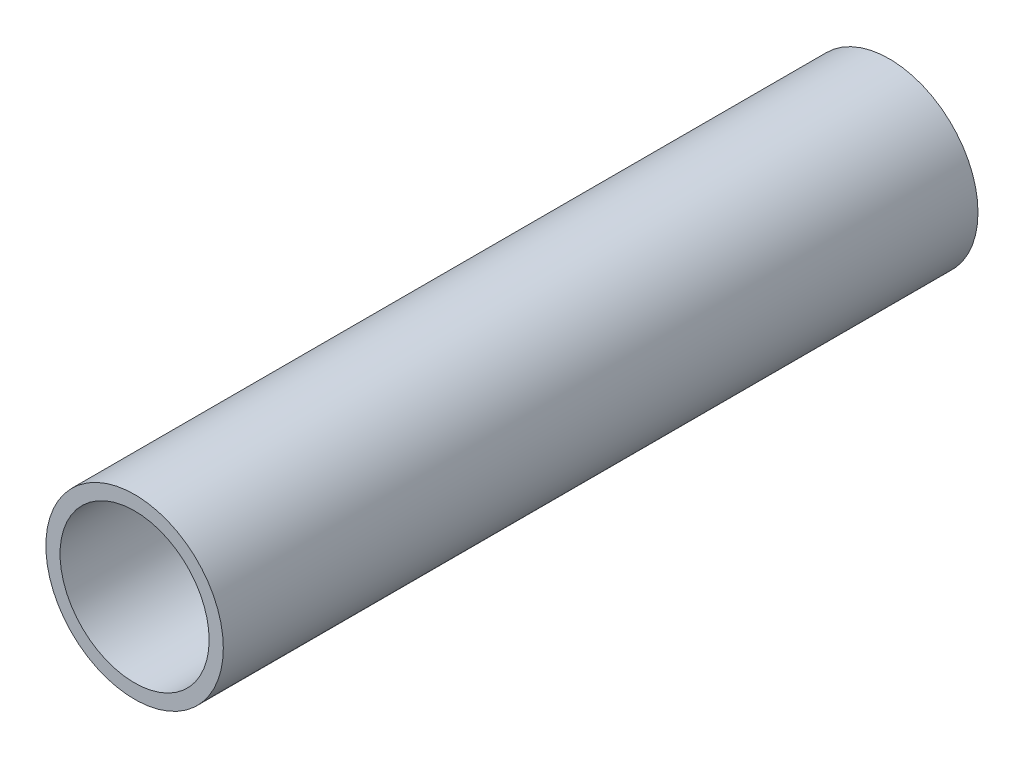
ISO-10303-21;
HEADER;
FILE_DESCRIPTION(('STEP AP214'),'2;1');
FILE_NAME('part.step','',(''),(''),'','','');
FILE_SCHEMA(('AUTOMOTIVE_DESIGN { 1 0 10303 214 1 1 1 1 }'));
ENDSEC;
DATA;
#1=APPLICATION_CONTEXT('core data for automotive mechanical design processes');
#2=APPLICATION_PROTOCOL_DEFINITION('international standard','automotive_design',2000,#1);
#3=PRODUCT_CONTEXT('',#1,'mechanical');
#4=PRODUCT('Part','Part','',(#3));
#5=PRODUCT_RELATED_PRODUCT_CATEGORY('part','',(#4));
#6=PRODUCT_DEFINITION_FORMATION('','',#4);
#7=PRODUCT_DEFINITION_CONTEXT('part definition',#1,'design');
#8=PRODUCT_DEFINITION('design','',#6,#7);
#9=PRODUCT_DEFINITION_SHAPE('','',#8);
#10=(LENGTH_UNIT() NAMED_UNIT(*) SI_UNIT(.MILLI.,.METRE.));
#11=(NAMED_UNIT(*) PLANE_ANGLE_UNIT() SI_UNIT($,.RADIAN.));
#12=(NAMED_UNIT(*) SI_UNIT($,.STERADIAN.) SOLID_ANGLE_UNIT());
#13=UNCERTAINTY_MEASURE_WITH_UNIT(LENGTH_MEASURE(1.E-05),#10,'distance_accuracy_value','');
#14=(GEOMETRIC_REPRESENTATION_CONTEXT(3) GLOBAL_UNCERTAINTY_ASSIGNED_CONTEXT((#13)) GLOBAL_UNIT_ASSIGNED_CONTEXT((#10,
#11,#12)) REPRESENTATION_CONTEXT('',''));
#15=CARTESIAN_POINT('',(0.,0.,0.));
#16=DIRECTION('',(0.,0.,1.));
#17=DIRECTION('',(1.,0.,0.));
#18=AXIS2_PLACEMENT_3D('',#15,#16,#17);
#19=CARTESIAN_POINT('',(0.,0.,54.));
#20=DIRECTION('',(0.,0.,1.));
#21=DIRECTION('',(1.,0.,0.));
#22=AXIS2_PLACEMENT_3D('',#19,#20,#21);
#23=PLANE('',#22);
#24=CARTESIAN_POINT('',(0.,0.,54.));
#25=DIRECTION('',(0.,0.,1.));
#26=DIRECTION('',(1.,0.,0.));
#27=AXIS2_PLACEMENT_3D('',#24,#25,#26);
#28=CIRCLE('',#27,6.35);
#29=CARTESIAN_POINT('',(6.35,0.,54.));
#30=VERTEX_POINT('',#29);
#31=EDGE_CURVE('E10',#30,#30,#28,.T.);
#32=ORIENTED_EDGE('',*,*,#31,.T.);
#33=EDGE_LOOP('',(#32));
#34=FACE_BOUND('',#33,.T.);
#35=CARTESIAN_POINT('',(0.,0.,54.));
#36=DIRECTION('',(0.,0.,1.));
#37=DIRECTION('',(1.,0.,0.));
#38=AXIS2_PLACEMENT_3D('',#35,#36,#37);
#39=CIRCLE('',#38,5.334);
#40=CARTESIAN_POINT('',(5.334,0.,54.));
#41=VERTEX_POINT('',#40);
#42=EDGE_CURVE('E46',#41,#41,#39,.T.);
#43=ORIENTED_EDGE('',*,*,#42,.F.);
#44=EDGE_LOOP('',(#43));
#45=FACE_BOUND('',#44,.T.);
#46=ADVANCED_FACE('F34',(#34,#45),#23,.T.);
#47=CARTESIAN_POINT('',(0.,0.,0.));
#48=DIRECTION('',(0.,0.,1.));
#49=DIRECTION('',(1.,0.,0.));
#50=AXIS2_PLACEMENT_3D('',#47,#48,#49);
#51=PLANE('',#50);
#52=CARTESIAN_POINT('',(0.,0.,0.));
#53=DIRECTION('',(0.,0.,1.));
#54=DIRECTION('',(1.,0.,0.));
#55=AXIS2_PLACEMENT_3D('',#52,#53,#54);
#56=CIRCLE('',#55,6.35);
#57=CARTESIAN_POINT('',(6.35,0.,0.));
#58=VERTEX_POINT('',#57);
#59=EDGE_CURVE('E38',#58,#58,#56,.T.);
#60=ORIENTED_EDGE('',*,*,#59,.F.);
#61=EDGE_LOOP('',(#60));
#62=FACE_BOUND('',#61,.T.);
#63=CARTESIAN_POINT('',(0.,0.,0.));
#64=DIRECTION('',(0.,0.,1.));
#65=DIRECTION('',(1.,0.,0.));
#66=AXIS2_PLACEMENT_3D('',#63,#64,#65);
#67=CIRCLE('',#66,5.334);
#68=CARTESIAN_POINT('',(5.334,0.,0.));
#69=VERTEX_POINT('',#68);
#70=EDGE_CURVE('E48',#69,#69,#67,.T.);
#71=ORIENTED_EDGE('',*,*,#70,.T.);
#72=EDGE_LOOP('',(#71));
#73=FACE_BOUND('',#72,.T.);
#74=ADVANCED_FACE('F59',(#62,#73),#51,.F.);
#75=CARTESIAN_POINT('',(0.,0.,54.));
#76=DIRECTION('',(0.,0.,-1.));
#77=DIRECTION('',(-1.,0.,0.));
#78=AXIS2_PLACEMENT_3D('',#75,#76,#77);
#79=CYLINDRICAL_SURFACE('',#78,6.35);
#80=ORIENTED_EDGE('',*,*,#31,.F.);
#81=EDGE_LOOP('',(#80));
#82=FACE_BOUND('',#81,.T.);
#83=ORIENTED_EDGE('',*,*,#59,.T.);
#84=EDGE_LOOP('',(#83));
#85=FACE_BOUND('',#84,.T.);
#86=ADVANCED_FACE('F36',(#82,#85),#79,.T.);
#87=CARTESIAN_POINT('',(0.,0.,54.));
#88=DIRECTION('',(0.,0.,-1.));
#89=DIRECTION('',(-1.,0.,0.));
#90=AXIS2_PLACEMENT_3D('',#87,#88,#89);
#91=CYLINDRICAL_SURFACE('',#90,5.334);
#92=ORIENTED_EDGE('',*,*,#42,.T.);
#93=EDGE_LOOP('',(#92));
#94=FACE_BOUND('',#93,.T.);
#95=ORIENTED_EDGE('',*,*,#70,.F.);
#96=EDGE_LOOP('',(#95));
#97=FACE_BOUND('',#96,.T.);
#98=ADVANCED_FACE('F55',(#94,#97),#91,.F.);
#99=CLOSED_SHELL('',(#46,#74,#86,#98));
#100=MANIFOLD_SOLID_BREP('B2',#99);
#101=ADVANCED_BREP_SHAPE_REPRESENTATION('',(#18,#100),#14);
#102=SHAPE_DEFINITION_REPRESENTATION(#9,#101);
ENDSEC;
END-ISO-10303-21;
